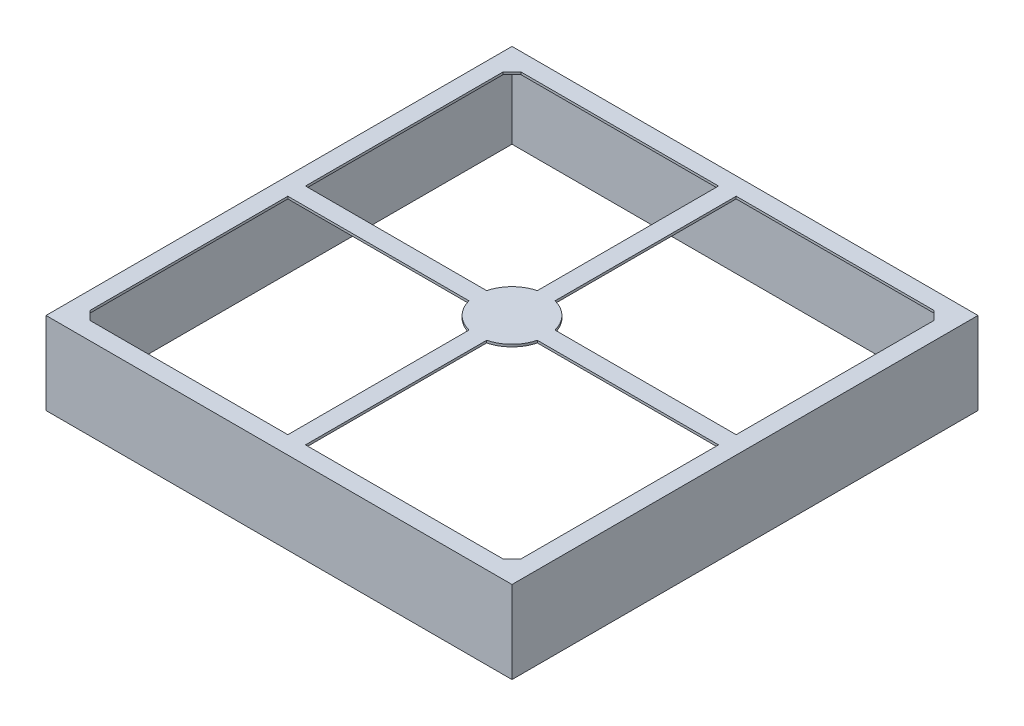
ISO-10303-21;
HEADER;
FILE_DESCRIPTION(('STEP AP214'),'2;1');
FILE_NAME('part.step','',(''),(''),'','','');
FILE_SCHEMA(('AUTOMOTIVE_DESIGN { 1 0 10303 214 1 1 1 1 }'));
ENDSEC;
DATA;
#1=APPLICATION_CONTEXT('core data for automotive mechanical design processes');
#2=APPLICATION_PROTOCOL_DEFINITION('international standard','automotive_design',2000,#1);
#3=PRODUCT_CONTEXT('',#1,'mechanical');
#4=PRODUCT('Part','Part','',(#3));
#5=PRODUCT_RELATED_PRODUCT_CATEGORY('part','',(#4));
#6=PRODUCT_DEFINITION_FORMATION('','',#4);
#7=PRODUCT_DEFINITION_CONTEXT('part definition',#1,'design');
#8=PRODUCT_DEFINITION('design','',#6,#7);
#9=PRODUCT_DEFINITION_SHAPE('','',#8);
#10=(LENGTH_UNIT() NAMED_UNIT(*) SI_UNIT(.MILLI.,.METRE.));
#11=(NAMED_UNIT(*) PLANE_ANGLE_UNIT() SI_UNIT($,.RADIAN.));
#12=(NAMED_UNIT(*) SI_UNIT($,.STERADIAN.) SOLID_ANGLE_UNIT());
#13=UNCERTAINTY_MEASURE_WITH_UNIT(LENGTH_MEASURE(1.E-05),#10,'distance_accuracy_value','');
#14=(GEOMETRIC_REPRESENTATION_CONTEXT(3) GLOBAL_UNCERTAINTY_ASSIGNED_CONTEXT((#13)) GLOBAL_UNIT_ASSIGNED_CONTEXT((#10,
#11,#12)) REPRESENTATION_CONTEXT('',''));
#15=CARTESIAN_POINT('',(0.,0.,0.));
#16=DIRECTION('',(0.,0.,1.));
#17=DIRECTION('',(1.,0.,0.));
#18=AXIS2_PLACEMENT_3D('',#15,#16,#17);
#19=CARTESIAN_POINT('',(19.8,7.,-19.8));
#20=DIRECTION('',(0.,-1.,0.));
#21=DIRECTION('',(0.,0.,-1.));
#22=AXIS2_PLACEMENT_3D('',#19,#20,#21);
#23=PLANE('',#22);
#24=DIRECTION('',(0.,0.,-1.));
#25=VECTOR('',#24,1.);
#26=CARTESIAN_POINT('',(18.3,7.,-0.75));
#27=LINE('',#26,#25);
#28=CARTESIAN_POINT('',(18.3,7.,-0.75));
#29=VERTEX_POINT('',#28);
#30=CARTESIAN_POINT('',(18.3,7.,-17.55));
#31=VERTEX_POINT('',#30);
#32=EDGE_CURVE('E254',#29,#31,#27,.T.);
#33=ORIENTED_EDGE('',*,*,#32,.F.);
#34=DIRECTION('',(1.,0.,0.));
#35=VECTOR('',#34,1.);
#36=CARTESIAN_POINT('',(18.3,7.,-0.75));
#37=LINE('',#36,#35);
#38=CARTESIAN_POINT('',(2.90473750965556,7.,-0.749999999999999));
#39=VERTEX_POINT('',#38);
#40=EDGE_CURVE('E288',#39,#29,#37,.T.);
#41=ORIENTED_EDGE('',*,*,#40,.F.);
#42=CARTESIAN_POINT('',(0.,7.,0.));
#43=DIRECTION('',(0.,-1.,0.));
#44=DIRECTION('',(0.,0.,1.));
#45=AXIS2_PLACEMENT_3D('',#42,#43,#44);
#46=CIRCLE('',#45,3.);
#47=CARTESIAN_POINT('',(0.75,7.,-2.90473750965557));
#48=VERTEX_POINT('',#47);
#49=EDGE_CURVE('E285',#48,#39,#46,.T.);
#50=ORIENTED_EDGE('',*,*,#49,.F.);
#51=DIRECTION('',(0.,0.,1.));
#52=VECTOR('',#51,1.);
#53=CARTESIAN_POINT('',(0.75,7.,-18.3));
#54=LINE('',#53,#52);
#55=CARTESIAN_POINT('',(0.75,7.,-18.3));
#56=VERTEX_POINT('',#55);
#57=EDGE_CURVE('E283',#56,#48,#54,.T.);
#58=ORIENTED_EDGE('',*,*,#57,.F.);
#59=DIRECTION('',(-1.,0.,0.));
#60=VECTOR('',#59,1.);
#61=CARTESIAN_POINT('',(17.55,7.,-18.3));
#62=LINE('',#61,#60);
#63=CARTESIAN_POINT('',(17.55,7.,-18.3));
#64=VERTEX_POINT('',#63);
#65=EDGE_CURVE('E281',#64,#56,#62,.T.);
#66=ORIENTED_EDGE('',*,*,#65,.F.);
#67=DIRECTION('',(-0.707106781186547,0.,-0.707106781186547));
#68=VECTOR('',#67,1.);
#69=CARTESIAN_POINT('',(18.3,7.,-17.55));
#70=LINE('',#69,#68);
#71=EDGE_CURVE('E279',#31,#64,#70,.T.);
#72=ORIENTED_EDGE('',*,*,#71,.F.);
#73=EDGE_LOOP('',(#33,#41,#50,#58,#66,#72));
#74=FACE_BOUND('',#73,.T.);
#75=CARTESIAN_POINT('',(0.,7.,0.));
#76=DIRECTION('',(0.,-1.,0.));
#77=DIRECTION('',(0.,0.,1.));
#78=AXIS2_PLACEMENT_3D('',#75,#76,#77);
#79=CIRCLE('',#78,3.);
#80=CARTESIAN_POINT('',(-0.75,7.,2.90473750965556));
#81=VERTEX_POINT('',#80);
#82=CARTESIAN_POINT('',(-2.90473750965557,7.,0.75));
#83=VERTEX_POINT('',#82);
#84=EDGE_CURVE('E337',#81,#83,#79,.T.);
#85=ORIENTED_EDGE('',*,*,#84,.F.);
#86=DIRECTION('',(0.,0.,-1.));
#87=VECTOR('',#86,1.);
#88=CARTESIAN_POINT('',(-0.75,7.,2.90473750965556));
#89=LINE('',#88,#87);
#90=CARTESIAN_POINT('',(-0.750000000000001,7.,18.3));
#91=VERTEX_POINT('',#90);
#92=EDGE_CURVE('E348',#91,#81,#89,.T.);
#93=ORIENTED_EDGE('',*,*,#92,.F.);
#94=DIRECTION('',(1.,0.,0.));
#95=VECTOR('',#94,1.);
#96=CARTESIAN_POINT('',(-0.75,7.,18.3));
#97=LINE('',#96,#95);
#98=CARTESIAN_POINT('',(-17.55,7.,18.3));
#99=VERTEX_POINT('',#98);
#100=EDGE_CURVE('E345',#99,#91,#97,.T.);
#101=ORIENTED_EDGE('',*,*,#100,.F.);
#102=DIRECTION('',(0.707106781186547,0.,0.707106781186547));
#103=VECTOR('',#102,1.);
#104=CARTESIAN_POINT('',(-17.55,7.,18.3));
#105=LINE('',#104,#103);
#106=CARTESIAN_POINT('',(-18.3,7.,17.55));
#107=VERTEX_POINT('',#106);
#108=EDGE_CURVE('E343',#107,#99,#105,.T.);
#109=ORIENTED_EDGE('',*,*,#108,.F.);
#110=DIRECTION('',(0.,0.,1.));
#111=VECTOR('',#110,1.);
#112=CARTESIAN_POINT('',(-18.3,7.,17.55));
#113=LINE('',#112,#111);
#114=CARTESIAN_POINT('',(-18.3,7.,0.75));
#115=VERTEX_POINT('',#114);
#116=EDGE_CURVE('E341',#115,#107,#113,.T.);
#117=ORIENTED_EDGE('',*,*,#116,.F.);
#118=DIRECTION('',(-1.,0.,0.));
#119=VECTOR('',#118,1.);
#120=CARTESIAN_POINT('',(-2.90473750965557,7.,0.75));
#121=LINE('',#120,#119);
#122=EDGE_CURVE('E339',#83,#115,#121,.T.);
#123=ORIENTED_EDGE('',*,*,#122,.F.);
#124=EDGE_LOOP('',(#85,#93,#101,#109,#117,#123));
#125=FACE_BOUND('',#124,.T.);
#126=DIRECTION('',(0.,0.,-1.));
#127=VECTOR('',#126,1.);
#128=CARTESIAN_POINT('',(19.8,7.,19.8));
#129=LINE('',#128,#127);
#130=CARTESIAN_POINT('',(19.8,7.,19.8));
#131=VERTEX_POINT('',#130);
#132=CARTESIAN_POINT('',(19.8,7.,-19.8));
#133=VERTEX_POINT('',#132);
#134=EDGE_CURVE('E399',#131,#133,#129,.T.);
#135=ORIENTED_EDGE('',*,*,#134,.T.);
#136=DIRECTION('',(-1.,0.,0.));
#137=VECTOR('',#136,1.);
#138=CARTESIAN_POINT('',(-19.8,7.,-19.8));
#139=LINE('',#138,#137);
#140=CARTESIAN_POINT('',(-19.8,7.,-19.8));
#141=VERTEX_POINT('',#140);
#142=EDGE_CURVE('E402',#133,#141,#139,.T.);
#143=ORIENTED_EDGE('',*,*,#142,.T.);
#144=DIRECTION('',(0.,0.,1.));
#145=VECTOR('',#144,1.);
#146=CARTESIAN_POINT('',(-19.8,7.,19.8));
#147=LINE('',#146,#145);
#148=CARTESIAN_POINT('',(-19.8,7.,19.8));
#149=VERTEX_POINT('',#148);
#150=EDGE_CURVE('E405',#141,#149,#147,.T.);
#151=ORIENTED_EDGE('',*,*,#150,.T.);
#152=DIRECTION('',(1.,0.,0.));
#153=VECTOR('',#152,1.);
#154=CARTESIAN_POINT('',(-19.8,7.,19.8));
#155=LINE('',#154,#153);
#156=EDGE_CURVE('E407',#149,#131,#155,.T.);
#157=ORIENTED_EDGE('',*,*,#156,.T.);
#158=EDGE_LOOP('',(#135,#143,#151,#157));
#159=FACE_BOUND('',#158,.T.);
#160=DIRECTION('',(-1.,0.,0.));
#161=VECTOR('',#160,1.);
#162=CARTESIAN_POINT('',(-0.75,7.,-18.3));
#163=LINE('',#162,#161);
#164=CARTESIAN_POINT('',(-0.75,7.,-18.3));
#165=VERTEX_POINT('',#164);
#166=CARTESIAN_POINT('',(-17.55,7.,-18.3));
#167=VERTEX_POINT('',#166);
#168=EDGE_CURVE('E307',#165,#167,#163,.T.);
#169=ORIENTED_EDGE('',*,*,#168,.F.);
#170=DIRECTION('',(0.,0.,-1.));
#171=VECTOR('',#170,1.);
#172=CARTESIAN_POINT('',(-0.75,7.,-18.3));
#173=LINE('',#172,#171);
#174=CARTESIAN_POINT('',(-0.749999999999998,7.,-2.90473750965557));
#175=VERTEX_POINT('',#174);
#176=EDGE_CURVE('E318',#175,#165,#173,.T.);
#177=ORIENTED_EDGE('',*,*,#176,.F.);
#178=CARTESIAN_POINT('',(0.,7.,0.));
#179=DIRECTION('',(0.,-1.,0.));
#180=DIRECTION('',(0.,0.,1.));
#181=AXIS2_PLACEMENT_3D('',#178,#179,#180);
#182=CIRCLE('',#181,3.);
#183=CARTESIAN_POINT('',(-2.90473750965557,7.,-0.750000000000002));
#184=VERTEX_POINT('',#183);
#185=EDGE_CURVE('E315',#184,#175,#182,.T.);
#186=ORIENTED_EDGE('',*,*,#185,.F.);
#187=DIRECTION('',(1.,0.,0.));
#188=VECTOR('',#187,1.);
#189=CARTESIAN_POINT('',(-2.90473750965557,7.,-0.75));
#190=LINE('',#189,#188);
#191=CARTESIAN_POINT('',(-18.3,7.,-0.75));
#192=VERTEX_POINT('',#191);
#193=EDGE_CURVE('E313',#192,#184,#190,.T.);
#194=ORIENTED_EDGE('',*,*,#193,.F.);
#195=DIRECTION('',(0.,0.,1.));
#196=VECTOR('',#195,1.);
#197=CARTESIAN_POINT('',(-18.3,7.,-0.75));
#198=LINE('',#197,#196);
#199=CARTESIAN_POINT('',(-18.3,7.,-17.55));
#200=VERTEX_POINT('',#199);
#201=EDGE_CURVE('E311',#200,#192,#198,.T.);
#202=ORIENTED_EDGE('',*,*,#201,.F.);
#203=DIRECTION('',(-0.707106781186547,0.,0.707106781186547));
#204=VECTOR('',#203,1.);
#205=CARTESIAN_POINT('',(-17.55,7.,-18.3));
#206=LINE('',#205,#204);
#207=EDGE_CURVE('E309',#167,#200,#206,.T.);
#208=ORIENTED_EDGE('',*,*,#207,.F.);
#209=EDGE_LOOP('',(#169,#177,#186,#194,#202,#208));
#210=FACE_BOUND('',#209,.T.);
#211=DIRECTION('',(0.,0.,1.));
#212=VECTOR('',#211,1.);
#213=CARTESIAN_POINT('',(0.75,7.,2.90473750965556));
#214=LINE('',#213,#212);
#215=CARTESIAN_POINT('',(0.75,7.,2.90473750965556));
#216=VERTEX_POINT('',#215);
#217=CARTESIAN_POINT('',(0.75,7.,18.3));
#218=VERTEX_POINT('',#217);
#219=EDGE_CURVE('E240',#216,#218,#214,.T.);
#220=ORIENTED_EDGE('',*,*,#219,.F.);
#221=CARTESIAN_POINT('',(0.,7.,0.));
#222=DIRECTION('',(0.,-1.,0.));
#223=DIRECTION('',(0.,0.,1.));
#224=AXIS2_PLACEMENT_3D('',#221,#222,#223);
#225=CIRCLE('',#224,3.);
#226=CARTESIAN_POINT('',(2.90473750965556,7.,0.749999999999999));
#227=VERTEX_POINT('',#226);
#228=EDGE_CURVE('E267',#227,#216,#225,.T.);
#229=ORIENTED_EDGE('',*,*,#228,.F.);
#230=DIRECTION('',(-1.,0.,0.));
#231=VECTOR('',#230,1.);
#232=CARTESIAN_POINT('',(18.3,7.,0.75));
#233=LINE('',#232,#231);
#234=CARTESIAN_POINT('',(18.3,7.,0.75));
#235=VERTEX_POINT('',#234);
#236=EDGE_CURVE('E265',#235,#227,#233,.T.);
#237=ORIENTED_EDGE('',*,*,#236,.F.);
#238=DIRECTION('',(0.,0.,-1.));
#239=VECTOR('',#238,1.);
#240=CARTESIAN_POINT('',(18.3,7.,17.55));
#241=LINE('',#240,#239);
#242=CARTESIAN_POINT('',(18.3,7.,17.55));
#243=VERTEX_POINT('',#242);
#244=EDGE_CURVE('E261',#243,#235,#241,.T.);
#245=ORIENTED_EDGE('',*,*,#244,.F.);
#246=DIRECTION('',(0.707106781186547,0.,-0.707106781186547));
#247=VECTOR('',#246,1.);
#248=CARTESIAN_POINT('',(17.55,7.,18.3));
#249=LINE('',#248,#247);
#250=CARTESIAN_POINT('',(17.55,7.,18.3));
#251=VERTEX_POINT('',#250);
#252=EDGE_CURVE('E259',#251,#243,#249,.T.);
#253=ORIENTED_EDGE('',*,*,#252,.F.);
#254=DIRECTION('',(1.,0.,0.));
#255=VECTOR('',#254,1.);
#256=CARTESIAN_POINT('',(17.55,7.,18.3));
#257=LINE('',#256,#255);
#258=EDGE_CURVE('E247',#218,#251,#257,.T.);
#259=ORIENTED_EDGE('',*,*,#258,.F.);
#260=EDGE_LOOP('',(#220,#229,#237,#245,#253,#259));
#261=FACE_BOUND('',#260,.T.);
#262=ADVANCED_FACE('F32',(#74,#125,#159,#210,#261),#23,.F.);
#263=CARTESIAN_POINT('',(19.8,6.8,-19.8));
#264=DIRECTION('',(0.,-1.,0.));
#265=DIRECTION('',(0.,0.,-1.));
#266=AXIS2_PLACEMENT_3D('',#263,#264,#265);
#267=PLANE('',#266);
#268=DIRECTION('',(1.,0.,0.));
#269=VECTOR('',#268,1.);
#270=CARTESIAN_POINT('',(19.8,6.8,-0.750000000000001));
#271=LINE('',#270,#269);
#272=CARTESIAN_POINT('',(2.90473750965556,6.8,-0.749999999999999));
#273=VERTEX_POINT('',#272);
#274=CARTESIAN_POINT('',(18.3,6.8,-0.750000000000001));
#275=VERTEX_POINT('',#274);
#276=EDGE_CURVE('E464',#273,#275,#271,.T.);
#277=ORIENTED_EDGE('',*,*,#276,.T.);
#278=DIRECTION('',(0.,0.,-1.));
#279=VECTOR('',#278,1.);
#280=CARTESIAN_POINT('',(18.3,6.8,-19.8));
#281=LINE('',#280,#279);
#282=CARTESIAN_POINT('',(18.3,6.8,-17.55));
#283=VERTEX_POINT('',#282);
#284=EDGE_CURVE('E479',#275,#283,#281,.T.);
#285=ORIENTED_EDGE('',*,*,#284,.T.);
#286=DIRECTION('',(-0.707106781186548,0.,-0.707106781186548));
#287=VECTOR('',#286,1.);
#288=CARTESIAN_POINT('',(17.925,6.8,-17.925));
#289=LINE('',#288,#287);
#290=CARTESIAN_POINT('',(17.55,6.8,-18.3));
#291=VERTEX_POINT('',#290);
#292=EDGE_CURVE('E476',#283,#291,#289,.T.);
#293=ORIENTED_EDGE('',*,*,#292,.T.);
#294=DIRECTION('',(-1.,0.,0.));
#295=VECTOR('',#294,1.);
#296=CARTESIAN_POINT('',(19.8,6.8,-18.3));
#297=LINE('',#296,#295);
#298=CARTESIAN_POINT('',(0.75,6.8,-18.3));
#299=VERTEX_POINT('',#298);
#300=EDGE_CURVE('E473',#291,#299,#297,.T.);
#301=ORIENTED_EDGE('',*,*,#300,.T.);
#302=DIRECTION('',(0.,0.,1.));
#303=VECTOR('',#302,1.);
#304=CARTESIAN_POINT('',(0.750000000000001,6.8,-19.8));
#305=LINE('',#304,#303);
#306=CARTESIAN_POINT('',(0.75,6.8,-2.90473750965557));
#307=VERTEX_POINT('',#306);
#308=EDGE_CURVE('E470',#299,#307,#305,.T.);
#309=ORIENTED_EDGE('',*,*,#308,.T.);
#310=CARTESIAN_POINT('',(0.,6.8,0.));
#311=DIRECTION('',(0.,-1.,0.));
#312=DIRECTION('',(0.,0.,-1.));
#313=AXIS2_PLACEMENT_3D('',#310,#311,#312);
#314=CIRCLE('',#313,3.);
#315=EDGE_CURVE('E467',#307,#273,#314,.T.);
#316=ORIENTED_EDGE('',*,*,#315,.T.);
#317=EDGE_LOOP('',(#277,#285,#293,#301,#309,#316));
#318=FACE_BOUND('',#317,.T.);
#319=DIRECTION('',(0.,0.,-1.));
#320=VECTOR('',#319,1.);
#321=CARTESIAN_POINT('',(-0.750000000000001,6.8,-19.8));
#322=LINE('',#321,#320);
#323=CARTESIAN_POINT('',(-0.75,6.8,18.3));
#324=VERTEX_POINT('',#323);
#325=CARTESIAN_POINT('',(-0.750000000000001,6.8,2.90473750965556));
#326=VERTEX_POINT('',#325);
#327=EDGE_CURVE('E428',#324,#326,#322,.T.);
#328=ORIENTED_EDGE('',*,*,#327,.T.);
#329=CARTESIAN_POINT('',(0.,6.8,0.));
#330=DIRECTION('',(0.,-1.,0.));
#331=DIRECTION('',(0.,0.,-1.));
#332=AXIS2_PLACEMENT_3D('',#329,#330,#331);
#333=CIRCLE('',#332,3.);
#334=CARTESIAN_POINT('',(-2.90473750965557,6.8,0.75));
#335=VERTEX_POINT('',#334);
#336=EDGE_CURVE('E443',#326,#335,#333,.T.);
#337=ORIENTED_EDGE('',*,*,#336,.T.);
#338=DIRECTION('',(-1.,0.,0.));
#339=VECTOR('',#338,1.);
#340=CARTESIAN_POINT('',(19.8,6.8,0.750000000000001));
#341=LINE('',#340,#339);
#342=CARTESIAN_POINT('',(-18.3,6.8,0.75));
#343=VERTEX_POINT('',#342);
#344=EDGE_CURVE('E440',#335,#343,#341,.T.);
#345=ORIENTED_EDGE('',*,*,#344,.T.);
#346=DIRECTION('',(0.,0.,1.));
#347=VECTOR('',#346,1.);
#348=CARTESIAN_POINT('',(-18.3,6.8,-19.8));
#349=LINE('',#348,#347);
#350=CARTESIAN_POINT('',(-18.3,6.8,17.55));
#351=VERTEX_POINT('',#350);
#352=EDGE_CURVE('E437',#343,#351,#349,.T.);
#353=ORIENTED_EDGE('',*,*,#352,.T.);
#354=DIRECTION('',(0.707106781186548,0.,0.707106781186548));
#355=VECTOR('',#354,1.);
#356=CARTESIAN_POINT('',(-17.925,6.8,17.925));
#357=LINE('',#356,#355);
#358=CARTESIAN_POINT('',(-17.55,6.8,18.3));
#359=VERTEX_POINT('',#358);
#360=EDGE_CURVE('E434',#351,#359,#357,.T.);
#361=ORIENTED_EDGE('',*,*,#360,.T.);
#362=DIRECTION('',(1.,0.,0.));
#363=VECTOR('',#362,1.);
#364=CARTESIAN_POINT('',(19.8,6.8,18.3));
#365=LINE('',#364,#363);
#366=EDGE_CURVE('E431',#359,#324,#365,.T.);
#367=ORIENTED_EDGE('',*,*,#366,.T.);
#368=EDGE_LOOP('',(#328,#337,#345,#353,#361,#367));
#369=FACE_BOUND('',#368,.T.);
#370=DIRECTION('',(0.,0.,-1.));
#371=VECTOR('',#370,1.);
#372=CARTESIAN_POINT('',(19.6,6.8,-19.8));
#373=LINE('',#372,#371);
#374=CARTESIAN_POINT('',(19.6,6.8,19.6));
#375=VERTEX_POINT('',#374);
#376=CARTESIAN_POINT('',(19.6,6.8,-19.6));
#377=VERTEX_POINT('',#376);
#378=EDGE_CURVE('E373',#375,#377,#373,.T.);
#379=ORIENTED_EDGE('',*,*,#378,.F.);
#380=DIRECTION('',(1.,0.,0.));
#381=VECTOR('',#380,1.);
#382=CARTESIAN_POINT('',(19.8,6.8,19.6));
#383=LINE('',#382,#381);
#384=CARTESIAN_POINT('',(-19.6,6.8,19.6));
#385=VERTEX_POINT('',#384);
#386=EDGE_CURVE('E381',#385,#375,#383,.T.);
#387=ORIENTED_EDGE('',*,*,#386,.F.);
#388=DIRECTION('',(0.,0.,1.));
#389=VECTOR('',#388,1.);
#390=CARTESIAN_POINT('',(-19.6,6.8,-19.8));
#391=LINE('',#390,#389);
#392=CARTESIAN_POINT('',(-19.6,6.8,-19.6));
#393=VERTEX_POINT('',#392);
#394=EDGE_CURVE('E385',#393,#385,#391,.T.);
#395=ORIENTED_EDGE('',*,*,#394,.F.);
#396=DIRECTION('',(-1.,0.,0.));
#397=VECTOR('',#396,1.);
#398=CARTESIAN_POINT('',(19.8,6.8,-19.6));
#399=LINE('',#398,#397);
#400=EDGE_CURVE('E376',#377,#393,#399,.T.);
#401=ORIENTED_EDGE('',*,*,#400,.F.);
#402=EDGE_LOOP('',(#379,#387,#395,#401));
#403=FACE_BOUND('',#402,.T.);
#404=DIRECTION('',(0.,0.,-1.));
#405=VECTOR('',#404,1.);
#406=CARTESIAN_POINT('',(-0.750000000000001,6.8,-19.8));
#407=LINE('',#406,#405);
#408=CARTESIAN_POINT('',(-0.749999999999998,6.8,-2.90473750965557));
#409=VERTEX_POINT('',#408);
#410=CARTESIAN_POINT('',(-0.75,6.8,-18.3));
#411=VERTEX_POINT('',#410);
#412=EDGE_CURVE('E446',#409,#411,#407,.T.);
#413=ORIENTED_EDGE('',*,*,#412,.T.);
#414=DIRECTION('',(-1.,0.,0.));
#415=VECTOR('',#414,1.);
#416=CARTESIAN_POINT('',(19.8,6.8,-18.3));
#417=LINE('',#416,#415);
#418=CARTESIAN_POINT('',(-17.55,6.8,-18.3));
#419=VERTEX_POINT('',#418);
#420=EDGE_CURVE('E461',#411,#419,#417,.T.);
#421=ORIENTED_EDGE('',*,*,#420,.T.);
#422=DIRECTION('',(-0.707106781186548,0.,0.707106781186548));
#423=VECTOR('',#422,1.);
#424=CARTESIAN_POINT('',(1.87499999999999,6.8,-37.725));
#425=LINE('',#424,#423);
#426=CARTESIAN_POINT('',(-18.3,6.8,-17.55));
#427=VERTEX_POINT('',#426);
#428=EDGE_CURVE('E458',#419,#427,#425,.T.);
#429=ORIENTED_EDGE('',*,*,#428,.T.);
#430=DIRECTION('',(0.,0.,1.));
#431=VECTOR('',#430,1.);
#432=CARTESIAN_POINT('',(-18.3,6.8,-19.8));
#433=LINE('',#432,#431);
#434=CARTESIAN_POINT('',(-18.3,6.8,-0.75));
#435=VERTEX_POINT('',#434);
#436=EDGE_CURVE('E455',#427,#435,#433,.T.);
#437=ORIENTED_EDGE('',*,*,#436,.T.);
#438=DIRECTION('',(1.,0.,0.));
#439=VECTOR('',#438,1.);
#440=CARTESIAN_POINT('',(19.8,6.8,-0.750000000000001));
#441=LINE('',#440,#439);
#442=CARTESIAN_POINT('',(-2.90473750965557,6.8,-0.750000000000002));
#443=VERTEX_POINT('',#442);
#444=EDGE_CURVE('E452',#435,#443,#441,.T.);
#445=ORIENTED_EDGE('',*,*,#444,.T.);
#446=CARTESIAN_POINT('',(0.,6.8,0.));
#447=DIRECTION('',(0.,-1.,0.));
#448=DIRECTION('',(0.,0.,-1.));
#449=AXIS2_PLACEMENT_3D('',#446,#447,#448);
#450=CIRCLE('',#449,3.);
#451=EDGE_CURVE('E449',#443,#409,#450,.T.);
#452=ORIENTED_EDGE('',*,*,#451,.T.);
#453=EDGE_LOOP('',(#413,#421,#429,#437,#445,#452));
#454=FACE_BOUND('',#453,.T.);
#455=CARTESIAN_POINT('',(0.,6.8,0.));
#456=DIRECTION('',(0.,-1.,0.));
#457=DIRECTION('',(0.,0.,-1.));
#458=AXIS2_PLACEMENT_3D('',#455,#456,#457);
#459=CIRCLE('',#458,3.);
#460=CARTESIAN_POINT('',(2.90473750965556,6.8,0.749999999999999));
#461=VERTEX_POINT('',#460);
#462=CARTESIAN_POINT('',(0.75,6.8,2.90473750965556));
#463=VERTEX_POINT('',#462);
#464=EDGE_CURVE('E482',#461,#463,#459,.T.);
#465=ORIENTED_EDGE('',*,*,#464,.T.);
#466=DIRECTION('',(0.,0.,1.));
#467=VECTOR('',#466,1.);
#468=CARTESIAN_POINT('',(0.750000000000001,6.8,-19.8));
#469=LINE('',#468,#467);
#470=CARTESIAN_POINT('',(0.75,6.8,18.3));
#471=VERTEX_POINT('',#470);
#472=EDGE_CURVE('E11',#463,#471,#469,.T.);
#473=ORIENTED_EDGE('',*,*,#472,.T.);
#474=DIRECTION('',(1.,0.,0.));
#475=VECTOR('',#474,1.);
#476=CARTESIAN_POINT('',(19.8,6.8,18.3));
#477=LINE('',#476,#475);
#478=CARTESIAN_POINT('',(17.55,6.8,18.3));
#479=VERTEX_POINT('',#478);
#480=EDGE_CURVE('E40',#471,#479,#477,.T.);
#481=ORIENTED_EDGE('',*,*,#480,.T.);
#482=DIRECTION('',(0.707106781186548,0.,-0.707106781186548));
#483=VECTOR('',#482,1.);
#484=CARTESIAN_POINT('',(37.725,6.8,-1.875));
#485=LINE('',#484,#483);
#486=CARTESIAN_POINT('',(18.3,6.8,17.55));
#487=VERTEX_POINT('',#486);
#488=EDGE_CURVE('E491',#479,#487,#485,.T.);
#489=ORIENTED_EDGE('',*,*,#488,.T.);
#490=DIRECTION('',(0.,0.,-1.));
#491=VECTOR('',#490,1.);
#492=CARTESIAN_POINT('',(18.3,6.8,-19.8));
#493=LINE('',#492,#491);
#494=CARTESIAN_POINT('',(18.3,6.8,0.75));
#495=VERTEX_POINT('',#494);
#496=EDGE_CURVE('E488',#487,#495,#493,.T.);
#497=ORIENTED_EDGE('',*,*,#496,.T.);
#498=DIRECTION('',(-1.,0.,0.));
#499=VECTOR('',#498,1.);
#500=CARTESIAN_POINT('',(19.8,6.8,0.750000000000001));
#501=LINE('',#500,#499);
#502=EDGE_CURVE('E485',#495,#461,#501,.T.);
#503=ORIENTED_EDGE('',*,*,#502,.T.);
#504=EDGE_LOOP('',(#465,#473,#481,#489,#497,#503));
#505=FACE_BOUND('',#504,.T.);
#506=ADVANCED_FACE('F494',(#318,#369,#403,#454,#505),#267,.T.);
#507=CARTESIAN_POINT('',(19.8,0.,-19.8));
#508=DIRECTION('',(0.,-1.,0.));
#509=DIRECTION('',(0.,0.,-1.));
#510=AXIS2_PLACEMENT_3D('',#507,#508,#509);
#511=PLANE('',#510);
#512=DIRECTION('',(0.,0.,-1.));
#513=VECTOR('',#512,1.);
#514=CARTESIAN_POINT('',(19.8,0.,19.8));
#515=LINE('',#514,#513);
#516=CARTESIAN_POINT('',(19.8,0.,19.8));
#517=VERTEX_POINT('',#516);
#518=CARTESIAN_POINT('',(19.8,0.,-19.8));
#519=VERTEX_POINT('',#518);
#520=EDGE_CURVE('E371',#517,#519,#515,.T.);
#521=ORIENTED_EDGE('',*,*,#520,.F.);
#522=DIRECTION('',(1.,0.,0.));
#523=VECTOR('',#522,1.);
#524=CARTESIAN_POINT('',(-19.8,0.,19.8));
#525=LINE('',#524,#523);
#526=CARTESIAN_POINT('',(-19.8,0.,19.8));
#527=VERTEX_POINT('',#526);
#528=EDGE_CURVE('E403',#527,#517,#525,.T.);
#529=ORIENTED_EDGE('',*,*,#528,.F.);
#530=DIRECTION('',(0.,0.,1.));
#531=VECTOR('',#530,1.);
#532=CARTESIAN_POINT('',(-19.8,0.,19.8));
#533=LINE('',#532,#531);
#534=CARTESIAN_POINT('',(-19.8,0.,-19.8));
#535=VERTEX_POINT('',#534);
#536=EDGE_CURVE('E414',#535,#527,#533,.T.);
#537=ORIENTED_EDGE('',*,*,#536,.F.);
#538=DIRECTION('',(-1.,0.,0.));
#539=VECTOR('',#538,1.);
#540=CARTESIAN_POINT('',(-19.8,0.,-19.8));
#541=LINE('',#540,#539);
#542=EDGE_CURVE('E412',#519,#535,#541,.T.);
#543=ORIENTED_EDGE('',*,*,#542,.F.);
#544=EDGE_LOOP('',(#521,#529,#537,#543));
#545=FACE_BOUND('',#544,.T.);
#546=DIRECTION('',(1.,0.,0.));
#547=VECTOR('',#546,1.);
#548=CARTESIAN_POINT('',(19.8,0.,19.6));
#549=LINE('',#548,#547);
#550=CARTESIAN_POINT('',(-19.6,0.,19.6));
#551=VERTEX_POINT('',#550);
#552=CARTESIAN_POINT('',(19.6,0.,19.6));
#553=VERTEX_POINT('',#552);
#554=EDGE_CURVE('E377',#551,#553,#549,.T.);
#555=ORIENTED_EDGE('',*,*,#554,.T.);
#556=DIRECTION('',(0.,0.,-1.));
#557=VECTOR('',#556,1.);
#558=CARTESIAN_POINT('',(19.6,0.,-19.8));
#559=LINE('',#558,#557);
#560=CARTESIAN_POINT('',(19.6,0.,-19.6));
#561=VERTEX_POINT('',#560);
#562=EDGE_CURVE('E367',#553,#561,#559,.T.);
#563=ORIENTED_EDGE('',*,*,#562,.T.);
#564=DIRECTION('',(-1.,0.,0.));
#565=VECTOR('',#564,1.);
#566=CARTESIAN_POINT('',(19.8,0.,-19.6));
#567=LINE('',#566,#565);
#568=CARTESIAN_POINT('',(-19.6,0.,-19.6));
#569=VERTEX_POINT('',#568);
#570=EDGE_CURVE('E391',#561,#569,#567,.T.);
#571=ORIENTED_EDGE('',*,*,#570,.T.);
#572=DIRECTION('',(0.,0.,1.));
#573=VECTOR('',#572,1.);
#574=CARTESIAN_POINT('',(-19.6,0.,-19.8));
#575=LINE('',#574,#573);
#576=EDGE_CURVE('E394',#569,#551,#575,.T.);
#577=ORIENTED_EDGE('',*,*,#576,.T.);
#578=EDGE_LOOP('',(#555,#563,#571,#577));
#579=FACE_BOUND('',#578,.T.);
#580=ADVANCED_FACE('F519',(#545,#579),#511,.T.);
#581=CARTESIAN_POINT('',(19.8,7.,19.8));
#582=DIRECTION('',(-1.,0.,0.));
#583=DIRECTION('',(0.,0.,1.));
#584=AXIS2_PLACEMENT_3D('',#581,#582,#583);
#585=PLANE('',#584);
#586=ORIENTED_EDGE('',*,*,#520,.T.);
#587=DIRECTION('',(0.,-1.,0.));
#588=VECTOR('',#587,1.);
#589=CARTESIAN_POINT('',(19.8,7.,-19.8));
#590=LINE('',#589,#588);
#591=EDGE_CURVE('E425',#133,#519,#590,.T.);
#592=ORIENTED_EDGE('',*,*,#591,.F.);
#593=ORIENTED_EDGE('',*,*,#134,.F.);
#594=DIRECTION('',(0.,-1.,0.));
#595=VECTOR('',#594,1.);
#596=CARTESIAN_POINT('',(19.8,7.,19.8));
#597=LINE('',#596,#595);
#598=EDGE_CURVE('E409',#131,#517,#597,.T.);
#599=ORIENTED_EDGE('',*,*,#598,.T.);
#600=EDGE_LOOP('',(#586,#592,#593,#599));
#601=FACE_BOUND('',#600,.T.);
#602=ADVANCED_FACE('F34',(#601),#585,.F.);
#603=CARTESIAN_POINT('',(-19.8,7.,-19.8));
#604=DIRECTION('',(0.,0.,1.));
#605=DIRECTION('',(1.,0.,0.));
#606=AXIS2_PLACEMENT_3D('',#603,#604,#605);
#607=PLANE('',#606);
#608=ORIENTED_EDGE('',*,*,#542,.T.);
#609=DIRECTION('',(0.,-1.,0.));
#610=VECTOR('',#609,1.);
#611=CARTESIAN_POINT('',(-19.8,7.,-19.8));
#612=LINE('',#611,#610);
#613=EDGE_CURVE('E422',#141,#535,#612,.T.);
#614=ORIENTED_EDGE('',*,*,#613,.F.);
#615=ORIENTED_EDGE('',*,*,#142,.F.);
#616=ORIENTED_EDGE('',*,*,#591,.T.);
#617=EDGE_LOOP('',(#608,#614,#615,#616));
#618=FACE_BOUND('',#617,.T.);
#619=ADVANCED_FACE('F536',(#618),#607,.F.);
#620=CARTESIAN_POINT('',(-19.8,7.,19.8));
#621=DIRECTION('',(1.,0.,0.));
#622=DIRECTION('',(0.,0.,-1.));
#623=AXIS2_PLACEMENT_3D('',#620,#621,#622);
#624=PLANE('',#623);
#625=ORIENTED_EDGE('',*,*,#536,.T.);
#626=DIRECTION('',(0.,-1.,0.));
#627=VECTOR('',#626,1.);
#628=CARTESIAN_POINT('',(-19.8,7.,19.8));
#629=LINE('',#628,#627);
#630=EDGE_CURVE('E419',#149,#527,#629,.T.);
#631=ORIENTED_EDGE('',*,*,#630,.F.);
#632=ORIENTED_EDGE('',*,*,#150,.F.);
#633=ORIENTED_EDGE('',*,*,#613,.T.);
#634=EDGE_LOOP('',(#625,#631,#632,#633));
#635=FACE_BOUND('',#634,.T.);
#636=ADVANCED_FACE('F533',(#635),#624,.F.);
#637=CARTESIAN_POINT('',(-19.8,7.,19.8));
#638=DIRECTION('',(0.,0.,-1.));
#639=DIRECTION('',(-1.,0.,0.));
#640=AXIS2_PLACEMENT_3D('',#637,#638,#639);
#641=PLANE('',#640);
#642=ORIENTED_EDGE('',*,*,#528,.T.);
#643=ORIENTED_EDGE('',*,*,#598,.F.);
#644=ORIENTED_EDGE('',*,*,#156,.F.);
#645=ORIENTED_EDGE('',*,*,#630,.T.);
#646=EDGE_LOOP('',(#642,#643,#644,#645));
#647=FACE_BOUND('',#646,.T.);
#648=ADVANCED_FACE('F529',(#647),#641,.F.);
#649=CARTESIAN_POINT('',(19.6,7.,19.8));
#650=DIRECTION('',(-1.,0.,0.));
#651=DIRECTION('',(0.,0.,1.));
#652=AXIS2_PLACEMENT_3D('',#649,#650,#651);
#653=PLANE('',#652);
#654=ORIENTED_EDGE('',*,*,#562,.F.);
#655=DIRECTION('',(0.,-1.,0.));
#656=VECTOR('',#655,1.);
#657=CARTESIAN_POINT('',(19.6,7.,19.6));
#658=LINE('',#657,#656);
#659=EDGE_CURVE('E378',#375,#553,#658,.T.);
#660=ORIENTED_EDGE('',*,*,#659,.F.);
#661=ORIENTED_EDGE('',*,*,#378,.T.);
#662=DIRECTION('',(0.,-1.,0.));
#663=VECTOR('',#662,1.);
#664=CARTESIAN_POINT('',(19.6,7.,-19.6));
#665=LINE('',#664,#663);
#666=EDGE_CURVE('E368',#377,#561,#665,.T.);
#667=ORIENTED_EDGE('',*,*,#666,.T.);
#668=EDGE_LOOP('',(#654,#660,#661,#667));
#669=FACE_BOUND('',#668,.T.);
#670=ADVANCED_FACE('F532',(#669),#653,.T.);
#671=CARTESIAN_POINT('',(-19.8,7.,-19.6));
#672=DIRECTION('',(0.,0.,1.));
#673=DIRECTION('',(1.,0.,0.));
#674=AXIS2_PLACEMENT_3D('',#671,#672,#673);
#675=PLANE('',#674);
#676=ORIENTED_EDGE('',*,*,#570,.F.);
#677=ORIENTED_EDGE('',*,*,#666,.F.);
#678=ORIENTED_EDGE('',*,*,#400,.T.);
#679=DIRECTION('',(0.,-1.,0.));
#680=VECTOR('',#679,1.);
#681=CARTESIAN_POINT('',(-19.6,7.,-19.6));
#682=LINE('',#681,#680);
#683=EDGE_CURVE('E372',#393,#569,#682,.T.);
#684=ORIENTED_EDGE('',*,*,#683,.T.);
#685=EDGE_LOOP('',(#676,#677,#678,#684));
#686=FACE_BOUND('',#685,.T.);
#687=ADVANCED_FACE('F621',(#686),#675,.T.);
#688=CARTESIAN_POINT('',(-19.6,7.,19.8));
#689=DIRECTION('',(1.,0.,0.));
#690=DIRECTION('',(0.,0.,-1.));
#691=AXIS2_PLACEMENT_3D('',#688,#689,#690);
#692=PLANE('',#691);
#693=ORIENTED_EDGE('',*,*,#576,.F.);
#694=ORIENTED_EDGE('',*,*,#683,.F.);
#695=ORIENTED_EDGE('',*,*,#394,.T.);
#696=DIRECTION('',(0.,-1.,0.));
#697=VECTOR('',#696,1.);
#698=CARTESIAN_POINT('',(-19.6,7.,19.6));
#699=LINE('',#698,#697);
#700=EDGE_CURVE('E380',#385,#551,#699,.T.);
#701=ORIENTED_EDGE('',*,*,#700,.T.);
#702=EDGE_LOOP('',(#693,#694,#695,#701));
#703=FACE_BOUND('',#702,.T.);
#704=ADVANCED_FACE('F625',(#703),#692,.T.);
#705=CARTESIAN_POINT('',(-19.8,7.,19.6));
#706=DIRECTION('',(0.,0.,-1.));
#707=DIRECTION('',(-1.,0.,0.));
#708=AXIS2_PLACEMENT_3D('',#705,#706,#707);
#709=PLANE('',#708);
#710=ORIENTED_EDGE('',*,*,#554,.F.);
#711=ORIENTED_EDGE('',*,*,#700,.F.);
#712=ORIENTED_EDGE('',*,*,#386,.T.);
#713=ORIENTED_EDGE('',*,*,#659,.T.);
#714=EDGE_LOOP('',(#710,#711,#712,#713));
#715=FACE_BOUND('',#714,.T.);
#716=ADVANCED_FACE('F617',(#715),#709,.T.);
#717=CARTESIAN_POINT('',(0.,7.,0.));
#718=DIRECTION('',(0.,-1.,0.));
#719=DIRECTION('',(0.,0.,-1.));
#720=AXIS2_PLACEMENT_3D('',#717,#718,#719);
#721=CYLINDRICAL_SURFACE('',#720,3.);
#722=DIRECTION('',(0.,-1.,0.));
#723=VECTOR('',#722,1.);
#724=CARTESIAN_POINT('',(-0.75,7.,2.90473750965556));
#725=LINE('',#724,#723);
#726=EDGE_CURVE('E350',#81,#326,#725,.T.);
#727=ORIENTED_EDGE('',*,*,#726,.F.);
#728=ORIENTED_EDGE('',*,*,#84,.T.);
#729=DIRECTION('',(0.,-1.,0.));
#730=VECTOR('',#729,1.);
#731=CARTESIAN_POINT('',(-2.90473750965557,7.,0.75));
#732=LINE('',#731,#730);
#733=EDGE_CURVE('E364',#83,#335,#732,.T.);
#734=ORIENTED_EDGE('',*,*,#733,.T.);
#735=ORIENTED_EDGE('',*,*,#336,.F.);
#736=EDGE_LOOP('',(#727,#728,#734,#735));
#737=FACE_BOUND('',#736,.T.);
#738=ADVANCED_FACE('F613',(#737),#721,.T.);
#739=CARTESIAN_POINT('',(-2.90473750965557,7.,0.75));
#740=DIRECTION('',(0.,0.,1.));
#741=DIRECTION('',(1.,0.,0.));
#742=AXIS2_PLACEMENT_3D('',#739,#740,#741);
#743=PLANE('',#742);
#744=ORIENTED_EDGE('',*,*,#733,.F.);
#745=ORIENTED_EDGE('',*,*,#122,.T.);
#746=DIRECTION('',(0.,-1.,0.));
#747=VECTOR('',#746,1.);
#748=CARTESIAN_POINT('',(-18.3,7.,0.75));
#749=LINE('',#748,#747);
#750=EDGE_CURVE('E361',#115,#343,#749,.T.);
#751=ORIENTED_EDGE('',*,*,#750,.T.);
#752=ORIENTED_EDGE('',*,*,#344,.F.);
#753=EDGE_LOOP('',(#744,#745,#751,#752));
#754=FACE_BOUND('',#753,.T.);
#755=ADVANCED_FACE('F609',(#754),#743,.T.);
#756=CARTESIAN_POINT('',(-18.3,7.,17.55));
#757=DIRECTION('',(1.,0.,0.));
#758=DIRECTION('',(0.,0.,-1.));
#759=AXIS2_PLACEMENT_3D('',#756,#757,#758);
#760=PLANE('',#759);
#761=ORIENTED_EDGE('',*,*,#750,.F.);
#762=ORIENTED_EDGE('',*,*,#116,.T.);
#763=DIRECTION('',(0.,-1.,0.));
#764=VECTOR('',#763,1.);
#765=CARTESIAN_POINT('',(-18.3,7.,17.55));
#766=LINE('',#765,#764);
#767=EDGE_CURVE('E358',#107,#351,#766,.T.);
#768=ORIENTED_EDGE('',*,*,#767,.T.);
#769=ORIENTED_EDGE('',*,*,#352,.F.);
#770=EDGE_LOOP('',(#761,#762,#768,#769));
#771=FACE_BOUND('',#770,.T.);
#772=ADVANCED_FACE('F605',(#771),#760,.T.);
#773=CARTESIAN_POINT('',(-17.55,7.,18.3));
#774=DIRECTION('',(0.707106781186548,0.,-0.707106781186548));
#775=DIRECTION('',(-0.707106781186548,0.,-0.707106781186548));
#776=AXIS2_PLACEMENT_3D('',#773,#774,#775);
#777=PLANE('',#776);
#778=ORIENTED_EDGE('',*,*,#767,.F.);
#779=ORIENTED_EDGE('',*,*,#108,.T.);
#780=DIRECTION('',(0.,-1.,0.));
#781=VECTOR('',#780,1.);
#782=CARTESIAN_POINT('',(-17.55,7.,18.3));
#783=LINE('',#782,#781);
#784=EDGE_CURVE('E355',#99,#359,#783,.T.);
#785=ORIENTED_EDGE('',*,*,#784,.T.);
#786=ORIENTED_EDGE('',*,*,#360,.F.);
#787=EDGE_LOOP('',(#778,#779,#785,#786));
#788=FACE_BOUND('',#787,.T.);
#789=ADVANCED_FACE('F601',(#788),#777,.T.);
#790=CARTESIAN_POINT('',(-0.75,7.,18.3));
#791=DIRECTION('',(0.,0.,-1.));
#792=DIRECTION('',(-1.,0.,0.));
#793=AXIS2_PLACEMENT_3D('',#790,#791,#792);
#794=PLANE('',#793);
#795=ORIENTED_EDGE('',*,*,#784,.F.);
#796=ORIENTED_EDGE('',*,*,#100,.T.);
#797=DIRECTION('',(0.,-1.,0.));
#798=VECTOR('',#797,1.);
#799=CARTESIAN_POINT('',(-0.75,7.,18.3));
#800=LINE('',#799,#798);
#801=EDGE_CURVE('E352',#91,#324,#800,.T.);
#802=ORIENTED_EDGE('',*,*,#801,.T.);
#803=ORIENTED_EDGE('',*,*,#366,.F.);
#804=EDGE_LOOP('',(#795,#796,#802,#803));
#805=FACE_BOUND('',#804,.T.);
#806=ADVANCED_FACE('F597',(#805),#794,.T.);
#807=CARTESIAN_POINT('',(-0.75,7.,2.90473750965556));
#808=DIRECTION('',(-1.,0.,0.));
#809=DIRECTION('',(0.,0.,1.));
#810=AXIS2_PLACEMENT_3D('',#807,#808,#809);
#811=PLANE('',#810);
#812=ORIENTED_EDGE('',*,*,#801,.F.);
#813=ORIENTED_EDGE('',*,*,#92,.T.);
#814=ORIENTED_EDGE('',*,*,#726,.T.);
#815=ORIENTED_EDGE('',*,*,#327,.F.);
#816=EDGE_LOOP('',(#812,#813,#814,#815));
#817=FACE_BOUND('',#816,.T.);
#818=ADVANCED_FACE('F594',(#817),#811,.T.);
#819=CARTESIAN_POINT('',(-0.75,7.,-18.3));
#820=DIRECTION('',(0.,0.,1.));
#821=DIRECTION('',(1.,0.,0.));
#822=AXIS2_PLACEMENT_3D('',#819,#820,#821);
#823=PLANE('',#822);
#824=DIRECTION('',(0.,-1.,0.));
#825=VECTOR('',#824,1.);
#826=CARTESIAN_POINT('',(-0.75,7.,-18.3));
#827=LINE('',#826,#825);
#828=EDGE_CURVE('E320',#165,#411,#827,.T.);
#829=ORIENTED_EDGE('',*,*,#828,.F.);
#830=ORIENTED_EDGE('',*,*,#168,.T.);
#831=DIRECTION('',(0.,-1.,0.));
#832=VECTOR('',#831,1.);
#833=CARTESIAN_POINT('',(-17.55,7.,-18.3));
#834=LINE('',#833,#832);
#835=EDGE_CURVE('E334',#167,#419,#834,.T.);
#836=ORIENTED_EDGE('',*,*,#835,.T.);
#837=ORIENTED_EDGE('',*,*,#420,.F.);
#838=EDGE_LOOP('',(#829,#830,#836,#837));
#839=FACE_BOUND('',#838,.T.);
#840=ADVANCED_FACE('F565',(#839),#823,.T.);
#841=CARTESIAN_POINT('',(-17.55,7.,-18.3));
#842=DIRECTION('',(0.707106781186548,0.,0.707106781186548));
#843=DIRECTION('',(0.707106781186548,0.,-0.707106781186548));
#844=AXIS2_PLACEMENT_3D('',#841,#842,#843);
#845=PLANE('',#844);
#846=ORIENTED_EDGE('',*,*,#835,.F.);
#847=ORIENTED_EDGE('',*,*,#207,.T.);
#848=DIRECTION('',(0.,-1.,0.));
#849=VECTOR('',#848,1.);
#850=CARTESIAN_POINT('',(-18.3,7.,-17.55));
#851=LINE('',#850,#849);
#852=EDGE_CURVE('E331',#200,#427,#851,.T.);
#853=ORIENTED_EDGE('',*,*,#852,.T.);
#854=ORIENTED_EDGE('',*,*,#428,.F.);
#855=EDGE_LOOP('',(#846,#847,#853,#854));
#856=FACE_BOUND('',#855,.T.);
#857=ADVANCED_FACE('F568',(#856),#845,.T.);
#858=CARTESIAN_POINT('',(-18.3,7.,-0.75));
#859=DIRECTION('',(1.,0.,0.));
#860=DIRECTION('',(0.,0.,-1.));
#861=AXIS2_PLACEMENT_3D('',#858,#859,#860);
#862=PLANE('',#861);
#863=ORIENTED_EDGE('',*,*,#852,.F.);
#864=ORIENTED_EDGE('',*,*,#201,.T.);
#865=DIRECTION('',(0.,-1.,0.));
#866=VECTOR('',#865,1.);
#867=CARTESIAN_POINT('',(-18.3,7.,-0.75));
#868=LINE('',#867,#866);
#869=EDGE_CURVE('E328',#192,#435,#868,.T.);
#870=ORIENTED_EDGE('',*,*,#869,.T.);
#871=ORIENTED_EDGE('',*,*,#436,.F.);
#872=EDGE_LOOP('',(#863,#864,#870,#871));
#873=FACE_BOUND('',#872,.T.);
#874=ADVANCED_FACE('F581',(#873),#862,.T.);
#875=CARTESIAN_POINT('',(-2.90473750965557,7.,-0.75));
#876=DIRECTION('',(0.,0.,-1.));
#877=DIRECTION('',(-1.,0.,0.));
#878=AXIS2_PLACEMENT_3D('',#875,#876,#877);
#879=PLANE('',#878);
#880=ORIENTED_EDGE('',*,*,#869,.F.);
#881=ORIENTED_EDGE('',*,*,#193,.T.);
#882=DIRECTION('',(0.,-1.,0.));
#883=VECTOR('',#882,1.);
#884=CARTESIAN_POINT('',(-2.90473750965557,7.,-0.750000000000002));
#885=LINE('',#884,#883);
#886=EDGE_CURVE('E325',#184,#443,#885,.T.);
#887=ORIENTED_EDGE('',*,*,#886,.T.);
#888=ORIENTED_EDGE('',*,*,#444,.F.);
#889=EDGE_LOOP('',(#880,#881,#887,#888));
#890=FACE_BOUND('',#889,.T.);
#891=ADVANCED_FACE('F579',(#890),#879,.T.);
#892=CARTESIAN_POINT('',(0.,7.,0.));
#893=DIRECTION('',(0.,-1.,0.));
#894=DIRECTION('',(0.,0.,-1.));
#895=AXIS2_PLACEMENT_3D('',#892,#893,#894);
#896=CYLINDRICAL_SURFACE('',#895,3.);
#897=ORIENTED_EDGE('',*,*,#886,.F.);
#898=ORIENTED_EDGE('',*,*,#185,.T.);
#899=DIRECTION('',(0.,-1.,0.));
#900=VECTOR('',#899,1.);
#901=CARTESIAN_POINT('',(-0.749999999999998,7.,-2.90473750965557));
#902=LINE('',#901,#900);
#903=EDGE_CURVE('E322',#175,#409,#902,.T.);
#904=ORIENTED_EDGE('',*,*,#903,.T.);
#905=ORIENTED_EDGE('',*,*,#451,.F.);
#906=EDGE_LOOP('',(#897,#898,#904,#905));
#907=FACE_BOUND('',#906,.T.);
#908=ADVANCED_FACE('F575',(#907),#896,.T.);
#909=CARTESIAN_POINT('',(-0.75,7.,-18.3));
#910=DIRECTION('',(-1.,0.,0.));
#911=DIRECTION('',(0.,0.,1.));
#912=AXIS2_PLACEMENT_3D('',#909,#910,#911);
#913=PLANE('',#912);
#914=ORIENTED_EDGE('',*,*,#903,.F.);
#915=ORIENTED_EDGE('',*,*,#176,.T.);
#916=ORIENTED_EDGE('',*,*,#828,.T.);
#917=ORIENTED_EDGE('',*,*,#412,.F.);
#918=EDGE_LOOP('',(#914,#915,#916,#917));
#919=FACE_BOUND('',#918,.T.);
#920=ADVANCED_FACE('F572',(#919),#913,.T.);
#921=CARTESIAN_POINT('',(18.3,7.,-0.75));
#922=DIRECTION('',(-1.,0.,0.));
#923=DIRECTION('',(0.,0.,1.));
#924=AXIS2_PLACEMENT_3D('',#921,#922,#923);
#925=PLANE('',#924);
#926=DIRECTION('',(0.,-1.,0.));
#927=VECTOR('',#926,1.);
#928=CARTESIAN_POINT('',(18.3,7.,-0.75));
#929=LINE('',#928,#927);
#930=EDGE_CURVE('E290',#29,#275,#929,.T.);
#931=ORIENTED_EDGE('',*,*,#930,.F.);
#932=ORIENTED_EDGE('',*,*,#32,.T.);
#933=DIRECTION('',(0.,-1.,0.));
#934=VECTOR('',#933,1.);
#935=CARTESIAN_POINT('',(18.3,7.,-17.55));
#936=LINE('',#935,#934);
#937=EDGE_CURVE('E304',#31,#283,#936,.T.);
#938=ORIENTED_EDGE('',*,*,#937,.T.);
#939=ORIENTED_EDGE('',*,*,#284,.F.);
#940=EDGE_LOOP('',(#931,#932,#938,#939));
#941=FACE_BOUND('',#940,.T.);
#942=ADVANCED_FACE('F704',(#941),#925,.T.);
#943=CARTESIAN_POINT('',(18.3,7.,-17.55));
#944=DIRECTION('',(-0.707106781186548,0.,0.707106781186548));
#945=DIRECTION('',(0.707106781186548,0.,0.707106781186548));
#946=AXIS2_PLACEMENT_3D('',#943,#944,#945);
#947=PLANE('',#946);
#948=ORIENTED_EDGE('',*,*,#937,.F.);
#949=ORIENTED_EDGE('',*,*,#71,.T.);
#950=DIRECTION('',(0.,-1.,0.));
#951=VECTOR('',#950,1.);
#952=CARTESIAN_POINT('',(17.55,7.,-18.3));
#953=LINE('',#952,#951);
#954=EDGE_CURVE('E301',#64,#291,#953,.T.);
#955=ORIENTED_EDGE('',*,*,#954,.T.);
#956=ORIENTED_EDGE('',*,*,#292,.F.);
#957=EDGE_LOOP('',(#948,#949,#955,#956));
#958=FACE_BOUND('',#957,.T.);
#959=ADVANCED_FACE('F713',(#958),#947,.T.);
#960=CARTESIAN_POINT('',(17.55,7.,-18.3));
#961=DIRECTION('',(0.,0.,1.));
#962=DIRECTION('',(1.,0.,0.));
#963=AXIS2_PLACEMENT_3D('',#960,#961,#962);
#964=PLANE('',#963);
#965=ORIENTED_EDGE('',*,*,#954,.F.);
#966=ORIENTED_EDGE('',*,*,#65,.T.);
#967=DIRECTION('',(0.,-1.,0.));
#968=VECTOR('',#967,1.);
#969=CARTESIAN_POINT('',(0.75,7.,-18.3));
#970=LINE('',#969,#968);
#971=EDGE_CURVE('E298',#56,#299,#970,.T.);
#972=ORIENTED_EDGE('',*,*,#971,.T.);
#973=ORIENTED_EDGE('',*,*,#300,.F.);
#974=EDGE_LOOP('',(#965,#966,#972,#973));
#975=FACE_BOUND('',#974,.T.);
#976=ADVANCED_FACE('F723',(#975),#964,.T.);
#977=CARTESIAN_POINT('',(0.75,7.,-18.3));
#978=DIRECTION('',(1.,0.,0.));
#979=DIRECTION('',(0.,0.,-1.));
#980=AXIS2_PLACEMENT_3D('',#977,#978,#979);
#981=PLANE('',#980);
#982=ORIENTED_EDGE('',*,*,#971,.F.);
#983=ORIENTED_EDGE('',*,*,#57,.T.);
#984=DIRECTION('',(0.,-1.,0.));
#985=VECTOR('',#984,1.);
#986=CARTESIAN_POINT('',(0.75,7.,-2.90473750965557));
#987=LINE('',#986,#985);
#988=EDGE_CURVE('E295',#48,#307,#987,.T.);
#989=ORIENTED_EDGE('',*,*,#988,.T.);
#990=ORIENTED_EDGE('',*,*,#308,.F.);
#991=EDGE_LOOP('',(#982,#983,#989,#990));
#992=FACE_BOUND('',#991,.T.);
#993=ADVANCED_FACE('F733',(#992),#981,.T.);
#994=CARTESIAN_POINT('',(0.,7.,0.));
#995=DIRECTION('',(0.,-1.,0.));
#996=DIRECTION('',(0.,0.,-1.));
#997=AXIS2_PLACEMENT_3D('',#994,#995,#996);
#998=CYLINDRICAL_SURFACE('',#997,3.);
#999=ORIENTED_EDGE('',*,*,#988,.F.);
#1000=ORIENTED_EDGE('',*,*,#49,.T.);
#1001=DIRECTION('',(0.,-1.,0.));
#1002=VECTOR('',#1001,1.);
#1003=CARTESIAN_POINT('',(2.90473750965556,7.,-0.749999999999999));
#1004=LINE('',#1003,#1002);
#1005=EDGE_CURVE('E292',#39,#273,#1004,.T.);
#1006=ORIENTED_EDGE('',*,*,#1005,.T.);
#1007=ORIENTED_EDGE('',*,*,#315,.F.);
#1008=EDGE_LOOP('',(#999,#1000,#1006,#1007));
#1009=FACE_BOUND('',#1008,.T.);
#1010=ADVANCED_FACE('F743',(#1009),#998,.T.);
#1011=CARTESIAN_POINT('',(18.3,7.,-0.75));
#1012=DIRECTION('',(0.,0.,-1.));
#1013=DIRECTION('',(-1.,0.,0.));
#1014=AXIS2_PLACEMENT_3D('',#1011,#1012,#1013);
#1015=PLANE('',#1014);
#1016=ORIENTED_EDGE('',*,*,#1005,.F.);
#1017=ORIENTED_EDGE('',*,*,#40,.T.);
#1018=ORIENTED_EDGE('',*,*,#930,.T.);
#1019=ORIENTED_EDGE('',*,*,#276,.F.);
#1020=EDGE_LOOP('',(#1016,#1017,#1018,#1019));
#1021=FACE_BOUND('',#1020,.T.);
#1022=ADVANCED_FACE('F753',(#1021),#1015,.T.);
#1023=CARTESIAN_POINT('',(0.75,7.,2.90473750965556));
#1024=DIRECTION('',(1.,0.,0.));
#1025=DIRECTION('',(0.,0.,-1.));
#1026=AXIS2_PLACEMENT_3D('',#1023,#1024,#1025);
#1027=PLANE('',#1026);
#1028=DIRECTION('',(0.,-1.,0.));
#1029=VECTOR('',#1028,1.);
#1030=CARTESIAN_POINT('',(0.75,7.,2.90473750965556));
#1031=LINE('',#1030,#1029);
#1032=EDGE_CURVE('E52',#216,#463,#1031,.T.);
#1033=ORIENTED_EDGE('',*,*,#1032,.F.);
#1034=ORIENTED_EDGE('',*,*,#219,.T.);
#1035=DIRECTION('',(0.,-1.,0.));
#1036=VECTOR('',#1035,1.);
#1037=CARTESIAN_POINT('',(0.75,7.,18.3));
#1038=LINE('',#1037,#1036);
#1039=EDGE_CURVE('E243',#218,#471,#1038,.T.);
#1040=ORIENTED_EDGE('',*,*,#1039,.T.);
#1041=ORIENTED_EDGE('',*,*,#472,.F.);
#1042=EDGE_LOOP('',(#1033,#1034,#1040,#1041));
#1043=FACE_BOUND('',#1042,.T.);
#1044=ADVANCED_FACE('F242',(#1043),#1027,.T.);
#1045=CARTESIAN_POINT('',(17.55,7.,18.3));
#1046=DIRECTION('',(0.,0.,-1.));
#1047=DIRECTION('',(-1.,0.,0.));
#1048=AXIS2_PLACEMENT_3D('',#1045,#1046,#1047);
#1049=PLANE('',#1048);
#1050=ORIENTED_EDGE('',*,*,#1039,.F.);
#1051=ORIENTED_EDGE('',*,*,#258,.T.);
#1052=DIRECTION('',(0.,-1.,0.));
#1053=VECTOR('',#1052,1.);
#1054=CARTESIAN_POINT('',(17.55,7.,18.3));
#1055=LINE('',#1054,#1053);
#1056=EDGE_CURVE('E255',#251,#479,#1055,.T.);
#1057=ORIENTED_EDGE('',*,*,#1056,.T.);
#1058=ORIENTED_EDGE('',*,*,#480,.F.);
#1059=EDGE_LOOP('',(#1050,#1051,#1057,#1058));
#1060=FACE_BOUND('',#1059,.T.);
#1061=ADVANCED_FACE('F250',(#1060),#1049,.T.);
#1062=CARTESIAN_POINT('',(17.55,7.,18.3));
#1063=DIRECTION('',(-0.707106781186548,0.,-0.707106781186548));
#1064=DIRECTION('',(-0.707106781186548,0.,0.707106781186548));
#1065=AXIS2_PLACEMENT_3D('',#1062,#1063,#1064);
#1066=PLANE('',#1065);
#1067=ORIENTED_EDGE('',*,*,#1056,.F.);
#1068=ORIENTED_EDGE('',*,*,#252,.T.);
#1069=DIRECTION('',(0.,-1.,0.));
#1070=VECTOR('',#1069,1.);
#1071=CARTESIAN_POINT('',(18.3,7.,17.55));
#1072=LINE('',#1071,#1070);
#1073=EDGE_CURVE('E274',#243,#487,#1072,.T.);
#1074=ORIENTED_EDGE('',*,*,#1073,.T.);
#1075=ORIENTED_EDGE('',*,*,#488,.F.);
#1076=EDGE_LOOP('',(#1067,#1068,#1074,#1075));
#1077=FACE_BOUND('',#1076,.T.);
#1078=ADVANCED_FACE('F504',(#1077),#1066,.T.);
#1079=CARTESIAN_POINT('',(18.3,7.,17.55));
#1080=DIRECTION('',(-1.,0.,0.));
#1081=DIRECTION('',(0.,0.,1.));
#1082=AXIS2_PLACEMENT_3D('',#1079,#1080,#1081);
#1083=PLANE('',#1082);
#1084=ORIENTED_EDGE('',*,*,#1073,.F.);
#1085=ORIENTED_EDGE('',*,*,#244,.T.);
#1086=DIRECTION('',(0.,-1.,0.));
#1087=VECTOR('',#1086,1.);
#1088=CARTESIAN_POINT('',(18.3,7.,0.75));
#1089=LINE('',#1088,#1087);
#1090=EDGE_CURVE('E271',#235,#495,#1089,.T.);
#1091=ORIENTED_EDGE('',*,*,#1090,.T.);
#1092=ORIENTED_EDGE('',*,*,#496,.F.);
#1093=EDGE_LOOP('',(#1084,#1085,#1091,#1092));
#1094=FACE_BOUND('',#1093,.T.);
#1095=ADVANCED_FACE('F502',(#1094),#1083,.T.);
#1096=CARTESIAN_POINT('',(18.3,7.,0.75));
#1097=DIRECTION('',(0.,0.,1.));
#1098=DIRECTION('',(1.,0.,0.));
#1099=AXIS2_PLACEMENT_3D('',#1096,#1097,#1098);
#1100=PLANE('',#1099);
#1101=ORIENTED_EDGE('',*,*,#1090,.F.);
#1102=ORIENTED_EDGE('',*,*,#236,.T.);
#1103=DIRECTION('',(0.,-1.,0.));
#1104=VECTOR('',#1103,1.);
#1105=CARTESIAN_POINT('',(2.90473750965556,7.,0.749999999999999));
#1106=LINE('',#1105,#1104);
#1107=EDGE_CURVE('E47',#227,#461,#1106,.T.);
#1108=ORIENTED_EDGE('',*,*,#1107,.T.);
#1109=ORIENTED_EDGE('',*,*,#502,.F.);
#1110=EDGE_LOOP('',(#1101,#1102,#1108,#1109));
#1111=FACE_BOUND('',#1110,.T.);
#1112=ADVANCED_FACE('F498',(#1111),#1100,.T.);
#1113=CARTESIAN_POINT('',(0.,7.,0.));
#1114=DIRECTION('',(0.,-1.,0.));
#1115=DIRECTION('',(0.,0.,-1.));
#1116=AXIS2_PLACEMENT_3D('',#1113,#1114,#1115);
#1117=CYLINDRICAL_SURFACE('',#1116,3.);
#1118=ORIENTED_EDGE('',*,*,#1107,.F.);
#1119=ORIENTED_EDGE('',*,*,#228,.T.);
#1120=ORIENTED_EDGE('',*,*,#1032,.T.);
#1121=ORIENTED_EDGE('',*,*,#464,.F.);
#1122=EDGE_LOOP('',(#1118,#1119,#1120,#1121));
#1123=FACE_BOUND('',#1122,.T.);
#1124=ADVANCED_FACE('F495',(#1123),#1117,.T.);
#1125=CLOSED_SHELL('',(#262,#506,#580,#602,#619,#636,#648,#670,#687,#704,#716,#738,#755,#772,
#789,#806,#818,#840,#857,#874,#891,#908,#920,#942,#959,#976,#993,#1010,#1022,#1044,#1061,#1078,
#1095,#1112,#1124));
#1126=MANIFOLD_SOLID_BREP('B2',#1125);
#1127=ADVANCED_BREP_SHAPE_REPRESENTATION('',(#18,#1126),#14);
#1128=SHAPE_DEFINITION_REPRESENTATION(#9,#1127);
ENDSEC;
END-ISO-10303-21;
